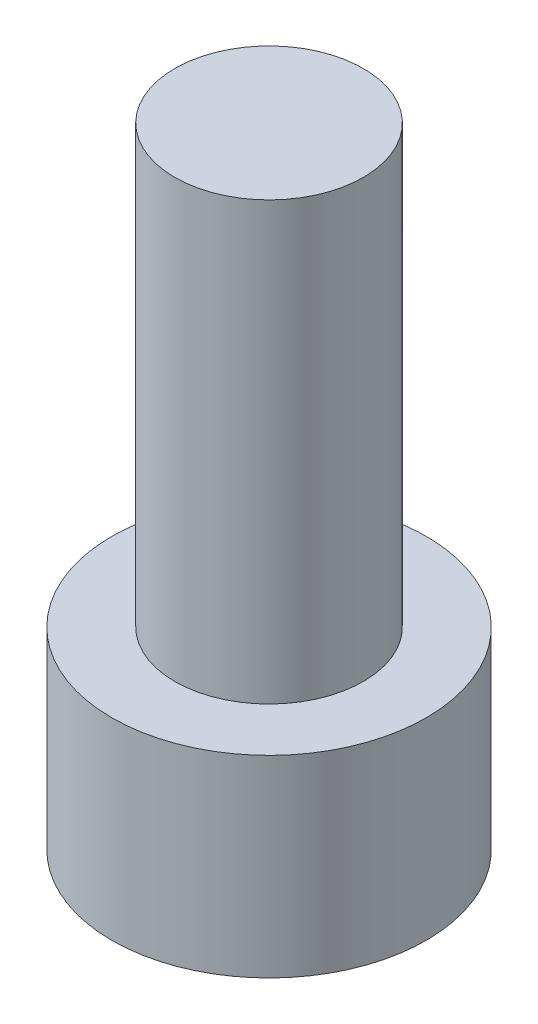
ISO-10303-21;
HEADER;
FILE_DESCRIPTION(('STEP AP214'),'2;1');
FILE_NAME('part.step','',(''),(''),'','','');
FILE_SCHEMA(('AUTOMOTIVE_DESIGN { 1 0 10303 214 1 1 1 1 }'));
ENDSEC;
DATA;
#1=APPLICATION_CONTEXT('core data for automotive mechanical design processes');
#2=APPLICATION_PROTOCOL_DEFINITION('international standard','automotive_design',2000,#1);
#3=PRODUCT_CONTEXT('',#1,'mechanical');
#4=PRODUCT('Part','Part','',(#3));
#5=PRODUCT_RELATED_PRODUCT_CATEGORY('part','',(#4));
#6=PRODUCT_DEFINITION_FORMATION('','',#4);
#7=PRODUCT_DEFINITION_CONTEXT('part definition',#1,'design');
#8=PRODUCT_DEFINITION('design','',#6,#7);
#9=PRODUCT_DEFINITION_SHAPE('','',#8);
#10=(LENGTH_UNIT() NAMED_UNIT(*) SI_UNIT(.MILLI.,.METRE.));
#11=(NAMED_UNIT(*) PLANE_ANGLE_UNIT() SI_UNIT($,.RADIAN.));
#12=(NAMED_UNIT(*) SI_UNIT($,.STERADIAN.) SOLID_ANGLE_UNIT());
#13=UNCERTAINTY_MEASURE_WITH_UNIT(LENGTH_MEASURE(1.E-05),#10,'distance_accuracy_value','');
#14=(GEOMETRIC_REPRESENTATION_CONTEXT(3) GLOBAL_UNCERTAINTY_ASSIGNED_CONTEXT((#13)) GLOBAL_UNIT_ASSIGNED_CONTEXT((#10,
#11,#12)) REPRESENTATION_CONTEXT('',''));
#15=CARTESIAN_POINT('',(0.,0.,0.));
#16=DIRECTION('',(0.,0.,1.));
#17=DIRECTION('',(1.,0.,0.));
#18=AXIS2_PLACEMENT_3D('',#15,#16,#17);
#19=CARTESIAN_POINT('',(0.,3.5052,0.));
#20=DIRECTION('',(0.,1.,0.));
#21=DIRECTION('',(0.,0.,1.));
#22=AXIS2_PLACEMENT_3D('',#19,#20,#21);
#23=PLANE('',#22);
#24=CARTESIAN_POINT('',(0.,3.5052,0.));
#25=DIRECTION('',(0.,1.,0.));
#26=DIRECTION('',(0.,0.,1.));
#27=AXIS2_PLACEMENT_3D('',#24,#25,#26);
#28=CIRCLE('',#27,2.8575);
#29=CARTESIAN_POINT('',(0.,3.5052,2.8575));
#30=VERTEX_POINT('',#29);
#31=EDGE_CURVE('E11',#30,#30,#28,.T.);
#32=ORIENTED_EDGE('',*,*,#31,.T.);
#33=EDGE_LOOP('',(#32));
#34=FACE_BOUND('',#33,.T.);
#35=CARTESIAN_POINT('',(0.,3.5052,0.));
#36=DIRECTION('',(0.,1.,0.));
#37=DIRECTION('',(0.,0.,1.));
#38=AXIS2_PLACEMENT_3D('',#35,#36,#37);
#39=CIRCLE('',#38,1.7145);
#40=CARTESIAN_POINT('',(0.,3.5052,1.7145));
#41=VERTEX_POINT('',#40);
#42=EDGE_CURVE('E152',#41,#41,#39,.T.);
#43=ORIENTED_EDGE('',*,*,#42,.F.);
#44=EDGE_LOOP('',(#43));
#45=FACE_BOUND('',#44,.T.);
#46=ADVANCED_FACE('F33',(#34,#45),#23,.T.);
#47=CARTESIAN_POINT('',(0.,3.5052,0.));
#48=DIRECTION('',(0.,-1.,0.));
#49=DIRECTION('',(0.,0.,-1.));
#50=AXIS2_PLACEMENT_3D('',#47,#48,#49);
#51=CYLINDRICAL_SURFACE('',#50,2.8575);
#52=ORIENTED_EDGE('',*,*,#31,.F.);
#53=EDGE_LOOP('',(#52));
#54=FACE_BOUND('',#53,.T.);
#55=CARTESIAN_POINT('',(0.,0.,0.));
#56=DIRECTION('',(0.,1.,0.));
#57=DIRECTION('',(0.,0.,1.));
#58=AXIS2_PLACEMENT_3D('',#55,#56,#57);
#59=CIRCLE('',#58,2.8575);
#60=CARTESIAN_POINT('',(0.,0.,2.8575));
#61=VERTEX_POINT('',#60);
#62=EDGE_CURVE('E37',#61,#61,#59,.T.);
#63=ORIENTED_EDGE('',*,*,#62,.T.);
#64=EDGE_LOOP('',(#63));
#65=FACE_BOUND('',#64,.T.);
#66=ADVANCED_FACE('F35',(#54,#65),#51,.T.);
#67=CARTESIAN_POINT('',(0.,0.,0.));
#68=DIRECTION('',(0.,1.,0.));
#69=DIRECTION('',(0.,0.,1.));
#70=AXIS2_PLACEMENT_3D('',#67,#68,#69);
#71=PLANE('',#70);
#72=DIRECTION('',(-0.500000000000001,0.,0.866025403784438));
#73=VECTOR('',#72,1.);
#74=CARTESIAN_POINT('',(1.60395121659243,0.,0.));
#75=LINE('',#74,#73);
#76=CARTESIAN_POINT('',(1.60395121659243,0.,0.));
#77=VERTEX_POINT('',#76);
#78=CARTESIAN_POINT('',(0.801975608296214,0.,1.3890625));
#79=VERTEX_POINT('',#78);
#80=EDGE_CURVE('E122',#77,#79,#75,.T.);
#81=ORIENTED_EDGE('',*,*,#80,.F.);
#82=DIRECTION('',(0.5,0.,0.866025403784439));
#83=VECTOR('',#82,1.);
#84=CARTESIAN_POINT('',(0.801975608296215,0.,-1.3890625));
#85=LINE('',#84,#83);
#86=CARTESIAN_POINT('',(0.801975608296215,0.,-1.3890625));
#87=VERTEX_POINT('',#86);
#88=EDGE_CURVE('E48',#87,#77,#85,.T.);
#89=ORIENTED_EDGE('',*,*,#88,.F.);
#90=DIRECTION('',(1.,0.,0.));
#91=VECTOR('',#90,1.);
#92=CARTESIAN_POINT('',(-0.801975608296214,0.,-1.3890625));
#93=LINE('',#92,#91);
#94=CARTESIAN_POINT('',(-0.801975608296214,0.,-1.3890625));
#95=VERTEX_POINT('',#94);
#96=EDGE_CURVE('E132',#95,#87,#93,.T.);
#97=ORIENTED_EDGE('',*,*,#96,.F.);
#98=DIRECTION('',(0.5,0.,-0.866025403784438));
#99=VECTOR('',#98,1.);
#100=CARTESIAN_POINT('',(-1.60395121659243,0.,0.));
#101=LINE('',#100,#99);
#102=CARTESIAN_POINT('',(-1.60395121659243,0.,0.));
#103=VERTEX_POINT('',#102);
#104=EDGE_CURVE('E130',#103,#95,#101,.T.);
#105=ORIENTED_EDGE('',*,*,#104,.F.);
#106=DIRECTION('',(-0.5,0.,-0.866025403784439));
#107=VECTOR('',#106,1.);
#108=CARTESIAN_POINT('',(-0.801975608296214,0.,1.3890625));
#109=LINE('',#108,#107);
#110=CARTESIAN_POINT('',(-0.801975608296214,0.,1.3890625));
#111=VERTEX_POINT('',#110);
#112=EDGE_CURVE('E96',#111,#103,#109,.T.);
#113=ORIENTED_EDGE('',*,*,#112,.F.);
#114=DIRECTION('',(-1.,0.,0.));
#115=VECTOR('',#114,1.);
#116=CARTESIAN_POINT('',(0.801975608296214,0.,1.3890625));
#117=LINE('',#116,#115);
#118=EDGE_CURVE('E126',#79,#111,#117,.T.);
#119=ORIENTED_EDGE('',*,*,#118,.F.);
#120=EDGE_LOOP('',(#81,#89,#97,#105,#113,#119));
#121=FACE_BOUND('',#120,.T.);
#122=ORIENTED_EDGE('',*,*,#62,.F.);
#123=EDGE_LOOP('',(#122));
#124=FACE_BOUND('',#123,.T.);
#125=ADVANCED_FACE('F145',(#121,#124),#71,.F.);
#126=CARTESIAN_POINT('',(0.801975608296215,1.9558,-1.3890625));
#127=DIRECTION('',(0.866025403784438,0.,-0.5));
#128=DIRECTION('',(-0.5,0.,-0.866025403784439));
#129=AXIS2_PLACEMENT_3D('',#126,#127,#128);
#130=PLANE('',#129);
#131=ORIENTED_EDGE('',*,*,#88,.T.);
#132=DIRECTION('',(0.,-1.,0.));
#133=VECTOR('',#132,1.);
#134=CARTESIAN_POINT('',(1.60395121659243,1.9558,0.));
#135=LINE('',#134,#133);
#136=CARTESIAN_POINT('',(1.60395121659243,1.9558,0.));
#137=VERTEX_POINT('',#136);
#138=EDGE_CURVE('E78',#137,#77,#135,.T.);
#139=ORIENTED_EDGE('',*,*,#138,.F.);
#140=DIRECTION('',(0.5,0.,0.866025403784439));
#141=VECTOR('',#140,1.);
#142=CARTESIAN_POINT('',(0.801975608296215,1.9558,-1.3890625));
#143=LINE('',#142,#141);
#144=CARTESIAN_POINT('',(0.801975608296215,1.9558,-1.3890625));
#145=VERTEX_POINT('',#144);
#146=EDGE_CURVE('E134',#145,#137,#143,.T.);
#147=ORIENTED_EDGE('',*,*,#146,.F.);
#148=DIRECTION('',(0.,-1.,0.));
#149=VECTOR('',#148,1.);
#150=CARTESIAN_POINT('',(0.801975608296215,1.9558,-1.3890625));
#151=LINE('',#150,#149);
#152=EDGE_CURVE('E56',#145,#87,#151,.T.);
#153=ORIENTED_EDGE('',*,*,#152,.T.);
#154=EDGE_LOOP('',(#131,#139,#147,#153));
#155=FACE_BOUND('',#154,.T.);
#156=ADVANCED_FACE('F174',(#155),#130,.F.);
#157=CARTESIAN_POINT('',(-0.801975608296214,1.9558,-1.3890625));
#158=DIRECTION('',(0.,0.,-1.));
#159=DIRECTION('',(-1.,0.,0.));
#160=AXIS2_PLACEMENT_3D('',#157,#158,#159);
#161=PLANE('',#160);
#162=ORIENTED_EDGE('',*,*,#96,.T.);
#163=ORIENTED_EDGE('',*,*,#152,.F.);
#164=DIRECTION('',(1.,0.,0.));
#165=VECTOR('',#164,1.);
#166=CARTESIAN_POINT('',(-0.801975608296214,1.9558,-1.3890625));
#167=LINE('',#166,#165);
#168=CARTESIAN_POINT('',(-0.801975608296214,1.9558,-1.3890625));
#169=VERTEX_POINT('',#168);
#170=EDGE_CURVE('E108',#169,#145,#167,.T.);
#171=ORIENTED_EDGE('',*,*,#170,.F.);
#172=DIRECTION('',(0.,-1.,0.));
#173=VECTOR('',#172,1.);
#174=CARTESIAN_POINT('',(-0.801975608296214,1.9558,-1.3890625));
#175=LINE('',#174,#173);
#176=EDGE_CURVE('E100',#169,#95,#175,.T.);
#177=ORIENTED_EDGE('',*,*,#176,.T.);
#178=EDGE_LOOP('',(#162,#163,#171,#177));
#179=FACE_BOUND('',#178,.T.);
#180=ADVANCED_FACE('F180',(#179),#161,.F.);
#181=CARTESIAN_POINT('',(-1.60395121659243,1.9558,0.));
#182=DIRECTION('',(-0.866025403784438,0.,-0.5));
#183=DIRECTION('',(-0.5,0.,0.866025403784439));
#184=AXIS2_PLACEMENT_3D('',#181,#182,#183);
#185=PLANE('',#184);
#186=ORIENTED_EDGE('',*,*,#104,.T.);
#187=ORIENTED_EDGE('',*,*,#176,.F.);
#188=DIRECTION('',(0.5,0.,-0.866025403784438));
#189=VECTOR('',#188,1.);
#190=CARTESIAN_POINT('',(-1.60395121659243,1.9558,0.));
#191=LINE('',#190,#189);
#192=CARTESIAN_POINT('',(-1.60395121659243,1.9558,0.));
#193=VERTEX_POINT('',#192);
#194=EDGE_CURVE('E104',#193,#169,#191,.T.);
#195=ORIENTED_EDGE('',*,*,#194,.F.);
#196=DIRECTION('',(0.,-1.,0.));
#197=VECTOR('',#196,1.);
#198=CARTESIAN_POINT('',(-1.60395121659243,1.9558,0.));
#199=LINE('',#198,#197);
#200=EDGE_CURVE('E89',#193,#103,#199,.T.);
#201=ORIENTED_EDGE('',*,*,#200,.T.);
#202=EDGE_LOOP('',(#186,#187,#195,#201));
#203=FACE_BOUND('',#202,.T.);
#204=ADVANCED_FACE('F105',(#203),#185,.F.);
#205=CARTESIAN_POINT('',(-0.801975608296214,1.9558,1.3890625));
#206=DIRECTION('',(-0.866025403784439,0.,0.5));
#207=DIRECTION('',(0.5,0.,0.866025403784439));
#208=AXIS2_PLACEMENT_3D('',#205,#206,#207);
#209=PLANE('',#208);
#210=ORIENTED_EDGE('',*,*,#112,.T.);
#211=ORIENTED_EDGE('',*,*,#200,.F.);
#212=DIRECTION('',(-0.5,0.,-0.866025403784439));
#213=VECTOR('',#212,1.);
#214=CARTESIAN_POINT('',(-0.801975608296214,1.9558,1.3890625));
#215=LINE('',#214,#213);
#216=CARTESIAN_POINT('',(-0.801975608296214,1.9558,1.3890625));
#217=VERTEX_POINT('',#216);
#218=EDGE_CURVE('E93',#217,#193,#215,.T.);
#219=ORIENTED_EDGE('',*,*,#218,.F.);
#220=DIRECTION('',(0.,-1.,0.));
#221=VECTOR('',#220,1.);
#222=CARTESIAN_POINT('',(-0.801975608296214,1.9558,1.3890625));
#223=LINE('',#222,#221);
#224=EDGE_CURVE('E101',#217,#111,#223,.T.);
#225=ORIENTED_EDGE('',*,*,#224,.T.);
#226=EDGE_LOOP('',(#210,#211,#219,#225));
#227=FACE_BOUND('',#226,.T.);
#228=ADVANCED_FACE('F91',(#227),#209,.F.);
#229=CARTESIAN_POINT('',(0.801975608296214,1.9558,1.3890625));
#230=DIRECTION('',(0.,0.,1.));
#231=DIRECTION('',(1.,0.,0.));
#232=AXIS2_PLACEMENT_3D('',#229,#230,#231);
#233=PLANE('',#232);
#234=ORIENTED_EDGE('',*,*,#118,.T.);
#235=ORIENTED_EDGE('',*,*,#224,.F.);
#236=DIRECTION('',(-1.,0.,0.));
#237=VECTOR('',#236,1.);
#238=CARTESIAN_POINT('',(0.801975608296214,1.9558,1.3890625));
#239=LINE('',#238,#237);
#240=CARTESIAN_POINT('',(0.801975608296214,1.9558,1.3890625));
#241=VERTEX_POINT('',#240);
#242=EDGE_CURVE('E114',#241,#217,#239,.T.);
#243=ORIENTED_EDGE('',*,*,#242,.F.);
#244=DIRECTION('',(0.,-1.,0.));
#245=VECTOR('',#244,1.);
#246=CARTESIAN_POINT('',(0.801975608296214,1.9558,1.3890625));
#247=LINE('',#246,#245);
#248=EDGE_CURVE('E138',#241,#79,#247,.T.);
#249=ORIENTED_EDGE('',*,*,#248,.T.);
#250=EDGE_LOOP('',(#234,#235,#243,#249));
#251=FACE_BOUND('',#250,.T.);
#252=ADVANCED_FACE('F149',(#251),#233,.F.);
#253=CARTESIAN_POINT('',(1.60395121659243,1.9558,0.));
#254=DIRECTION('',(0.866025403784438,0.,0.500000000000001));
#255=DIRECTION('',(0.500000000000001,0.,-0.866025403784438));
#256=AXIS2_PLACEMENT_3D('',#253,#254,#255);
#257=PLANE('',#256);
#258=ORIENTED_EDGE('',*,*,#80,.T.);
#259=ORIENTED_EDGE('',*,*,#248,.F.);
#260=DIRECTION('',(-0.500000000000001,0.,0.866025403784438));
#261=VECTOR('',#260,1.);
#262=CARTESIAN_POINT('',(1.60395121659243,1.9558,0.));
#263=LINE('',#262,#261);
#264=EDGE_CURVE('E116',#137,#241,#263,.T.);
#265=ORIENTED_EDGE('',*,*,#264,.F.);
#266=ORIENTED_EDGE('',*,*,#138,.T.);
#267=EDGE_LOOP('',(#258,#259,#265,#266));
#268=FACE_BOUND('',#267,.T.);
#269=ADVANCED_FACE('F142',(#268),#257,.F.);
#270=CARTESIAN_POINT('',(0.,1.9558,0.));
#271=DIRECTION('',(0.,-1.,0.));
#272=DIRECTION('',(0.,0.,-1.));
#273=AXIS2_PLACEMENT_3D('',#270,#271,#272);
#274=PLANE('',#273);
#275=ORIENTED_EDGE('',*,*,#146,.T.);
#276=ORIENTED_EDGE('',*,*,#264,.T.);
#277=ORIENTED_EDGE('',*,*,#242,.T.);
#278=ORIENTED_EDGE('',*,*,#218,.T.);
#279=ORIENTED_EDGE('',*,*,#194,.T.);
#280=ORIENTED_EDGE('',*,*,#170,.T.);
#281=EDGE_LOOP('',(#275,#276,#277,#278,#279,#280));
#282=FACE_BOUND('',#281,.T.);
#283=ADVANCED_FACE('F111',(#282),#274,.T.);
#284=CARTESIAN_POINT('',(0.,11.4427,0.));
#285=DIRECTION('',(0.,-1.,0.));
#286=DIRECTION('',(0.,0.,-1.));
#287=AXIS2_PLACEMENT_3D('',#284,#285,#286);
#288=CYLINDRICAL_SURFACE('',#287,1.7145);
#289=CARTESIAN_POINT('',(0.,11.4427,0.));
#290=DIRECTION('',(0.,1.,0.));
#291=DIRECTION('',(0.,0.,1.));
#292=AXIS2_PLACEMENT_3D('',#289,#290,#291);
#293=CIRCLE('',#292,1.7145);
#294=CARTESIAN_POINT('',(0.,11.4427,1.7145));
#295=VERTEX_POINT('',#294);
#296=EDGE_CURVE('E123',#295,#295,#293,.T.);
#297=ORIENTED_EDGE('',*,*,#296,.F.);
#298=EDGE_LOOP('',(#297));
#299=FACE_BOUND('',#298,.T.);
#300=ORIENTED_EDGE('',*,*,#42,.T.);
#301=EDGE_LOOP('',(#300));
#302=FACE_BOUND('',#301,.T.);
#303=ADVANCED_FACE('F160',(#299,#302),#288,.T.);
#304=CARTESIAN_POINT('',(0.,11.4427,0.));
#305=DIRECTION('',(0.,1.,0.));
#306=DIRECTION('',(0.,0.,1.));
#307=AXIS2_PLACEMENT_3D('',#304,#305,#306);
#308=PLANE('',#307);
#309=ORIENTED_EDGE('',*,*,#296,.T.);
#310=EDGE_LOOP('',(#309));
#311=FACE_BOUND('',#310,.T.);
#312=ADVANCED_FACE('F158',(#311),#308,.T.);
#313=CLOSED_SHELL('',(#46,#66,#125,#156,#180,#204,#228,#252,#269,#283,#303,#312));
#314=MANIFOLD_SOLID_BREP('B2',#313);
#315=ADVANCED_BREP_SHAPE_REPRESENTATION('',(#18,#314),#14);
#316=SHAPE_DEFINITION_REPRESENTATION(#9,#315);
ENDSEC;
END-ISO-10303-21;
